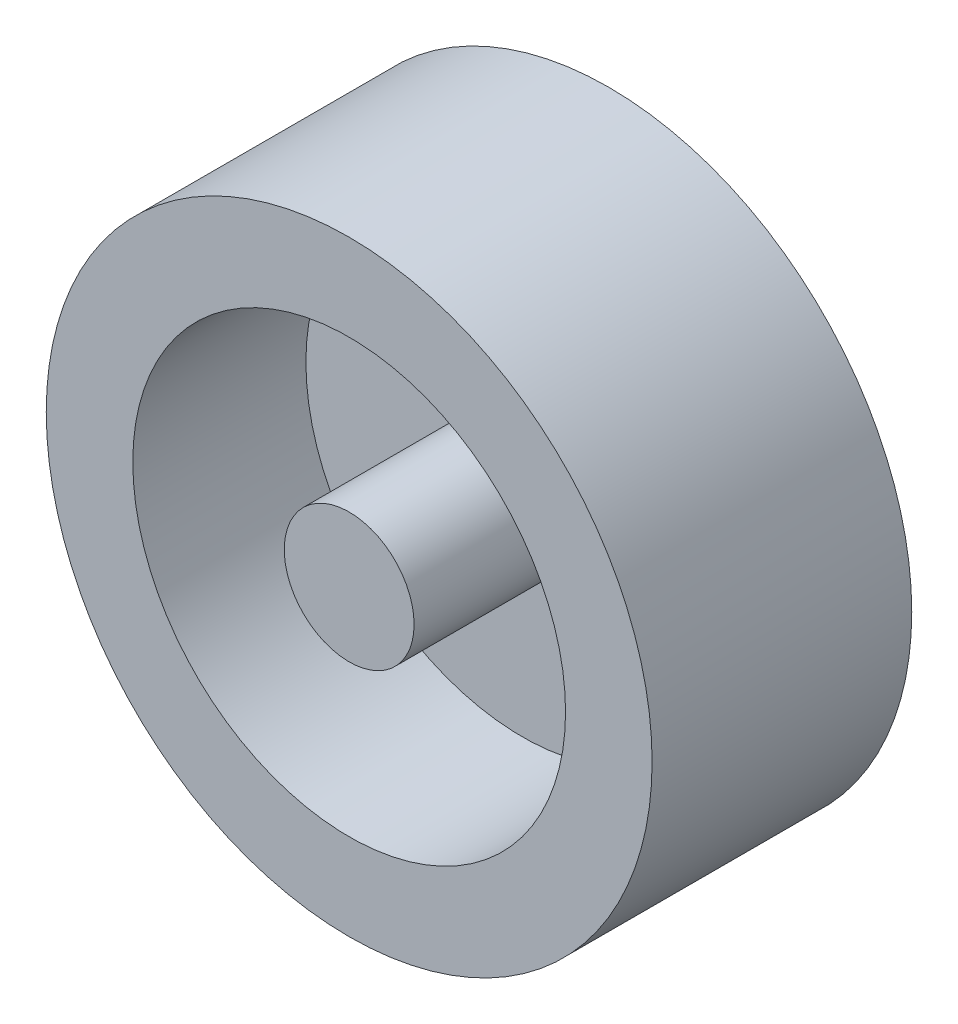
ISO-10303-21;
HEADER;
FILE_DESCRIPTION(('STEP AP214'),'2;1');
FILE_NAME('part.step','',(''),(''),'','','');
FILE_SCHEMA(('AUTOMOTIVE_DESIGN { 1 0 10303 214 1 1 1 1 }'));
ENDSEC;
DATA;
#1=APPLICATION_CONTEXT('core data for automotive mechanical design processes');
#2=APPLICATION_PROTOCOL_DEFINITION('international standard','automotive_design',2000,#1);
#3=PRODUCT_CONTEXT('',#1,'mechanical');
#4=PRODUCT('Part','Part','',(#3));
#5=PRODUCT_RELATED_PRODUCT_CATEGORY('part','',(#4));
#6=PRODUCT_DEFINITION_FORMATION('','',#4);
#7=PRODUCT_DEFINITION_CONTEXT('part definition',#1,'design');
#8=PRODUCT_DEFINITION('design','',#6,#7);
#9=PRODUCT_DEFINITION_SHAPE('','',#8);
#10=(LENGTH_UNIT() NAMED_UNIT(*) SI_UNIT(.MILLI.,.METRE.));
#11=(NAMED_UNIT(*) PLANE_ANGLE_UNIT() SI_UNIT($,.RADIAN.));
#12=(NAMED_UNIT(*) SI_UNIT($,.STERADIAN.) SOLID_ANGLE_UNIT());
#13=UNCERTAINTY_MEASURE_WITH_UNIT(LENGTH_MEASURE(1.E-05),#10,'distance_accuracy_value','');
#14=(GEOMETRIC_REPRESENTATION_CONTEXT(3) GLOBAL_UNCERTAINTY_ASSIGNED_CONTEXT((#13)) GLOBAL_UNIT_ASSIGNED_CONTEXT((#10,
#11,#12)) REPRESENTATION_CONTEXT('',''));
#15=CARTESIAN_POINT('',(0.,0.,0.));
#16=DIRECTION('',(0.,0.,1.));
#17=DIRECTION('',(1.,0.,0.));
#18=AXIS2_PLACEMENT_3D('',#15,#16,#17);
#19=CARTESIAN_POINT('',(0.,0.,3.));
#20=DIRECTION('',(0.,0.,-1.));
#21=DIRECTION('',(-1.,0.,0.));
#22=AXIS2_PLACEMENT_3D('',#19,#20,#21);
#23=CYLINDRICAL_SURFACE('',#22,3.5);
#24=CARTESIAN_POINT('',(0.,0.,3.));
#25=DIRECTION('',(0.,0.,1.));
#26=DIRECTION('',(1.,0.,0.));
#27=AXIS2_PLACEMENT_3D('',#24,#25,#26);
#28=CIRCLE('',#27,3.5);
#29=CARTESIAN_POINT('',(3.5,0.,3.));
#30=VERTEX_POINT('',#29);
#31=EDGE_CURVE('E10',#30,#30,#28,.T.);
#32=ORIENTED_EDGE('',*,*,#31,.F.);
#33=EDGE_LOOP('',(#32));
#34=FACE_BOUND('',#33,.T.);
#35=CARTESIAN_POINT('',(0.,0.,0.));
#36=DIRECTION('',(0.,0.,1.));
#37=DIRECTION('',(1.,0.,0.));
#38=AXIS2_PLACEMENT_3D('',#35,#36,#37);
#39=CIRCLE('',#38,3.5);
#40=CARTESIAN_POINT('',(3.5,0.,0.));
#41=VERTEX_POINT('',#40);
#42=EDGE_CURVE('E36',#41,#41,#39,.T.);
#43=ORIENTED_EDGE('',*,*,#42,.T.);
#44=EDGE_LOOP('',(#43));
#45=FACE_BOUND('',#44,.T.);
#46=ADVANCED_FACE('F33',(#34,#45),#23,.T.);
#47=CARTESIAN_POINT('',(0.,0.,3.));
#48=DIRECTION('',(0.,0.,1.));
#49=DIRECTION('',(1.,0.,0.));
#50=AXIS2_PLACEMENT_3D('',#47,#48,#49);
#51=PLANE('',#50);
#52=CARTESIAN_POINT('',(0.,0.,3.));
#53=DIRECTION('',(0.,0.,1.));
#54=DIRECTION('',(1.,0.,0.));
#55=AXIS2_PLACEMENT_3D('',#52,#53,#54);
#56=CIRCLE('',#55,2.5);
#57=CARTESIAN_POINT('',(2.5,0.,3.));
#58=VERTEX_POINT('',#57);
#59=EDGE_CURVE('E45',#58,#58,#56,.T.);
#60=ORIENTED_EDGE('',*,*,#59,.F.);
#61=EDGE_LOOP('',(#60));
#62=FACE_BOUND('',#61,.T.);
#63=ORIENTED_EDGE('',*,*,#31,.T.);
#64=EDGE_LOOP('',(#63));
#65=FACE_BOUND('',#64,.T.);
#66=ADVANCED_FACE('F78',(#62,#65),#51,.T.);
#67=CARTESIAN_POINT('',(0.,0.,0.));
#68=DIRECTION('',(0.,0.,1.));
#69=DIRECTION('',(1.,0.,0.));
#70=AXIS2_PLACEMENT_3D('',#67,#68,#69);
#71=PLANE('',#70);
#72=ORIENTED_EDGE('',*,*,#42,.F.);
#73=EDGE_LOOP('',(#72));
#74=FACE_BOUND('',#73,.T.);
#75=ADVANCED_FACE('F74',(#74),#71,.F.);
#76=CARTESIAN_POINT('',(0.,0.,1.));
#77=DIRECTION('',(0.,0.,1.));
#78=DIRECTION('',(1.,0.,0.));
#79=AXIS2_PLACEMENT_3D('',#76,#77,#78);
#80=CYLINDRICAL_SURFACE('',#79,2.5);
#81=CARTESIAN_POINT('',(0.,0.,1.));
#82=DIRECTION('',(0.,0.,1.));
#83=DIRECTION('',(1.,0.,0.));
#84=AXIS2_PLACEMENT_3D('',#81,#82,#83);
#85=CIRCLE('',#84,2.5);
#86=CARTESIAN_POINT('',(2.5,0.,1.));
#87=VERTEX_POINT('',#86);
#88=EDGE_CURVE('E43',#87,#87,#85,.T.);
#89=ORIENTED_EDGE('',*,*,#88,.F.);
#90=EDGE_LOOP('',(#89));
#91=FACE_BOUND('',#90,.T.);
#92=ORIENTED_EDGE('',*,*,#59,.T.);
#93=EDGE_LOOP('',(#92));
#94=FACE_BOUND('',#93,.T.);
#95=ADVANCED_FACE('F68',(#91,#94),#80,.F.);
#96=CARTESIAN_POINT('',(0.,0.,1.));
#97=DIRECTION('',(0.,0.,1.));
#98=DIRECTION('',(1.,0.,0.));
#99=AXIS2_PLACEMENT_3D('',#96,#97,#98);
#100=PLANE('',#99);
#101=CARTESIAN_POINT('',(0.,0.,1.));
#102=DIRECTION('',(0.,0.,1.));
#103=DIRECTION('',(1.,0.,0.));
#104=AXIS2_PLACEMENT_3D('',#101,#102,#103);
#105=CIRCLE('',#104,0.75);
#106=CARTESIAN_POINT('',(0.75,0.,1.));
#107=VERTEX_POINT('',#106);
#108=EDGE_CURVE('E51',#107,#107,#105,.T.);
#109=ORIENTED_EDGE('',*,*,#108,.F.);
#110=EDGE_LOOP('',(#109));
#111=FACE_BOUND('',#110,.T.);
#112=ORIENTED_EDGE('',*,*,#88,.T.);
#113=EDGE_LOOP('',(#112));
#114=FACE_BOUND('',#113,.T.);
#115=ADVANCED_FACE('F62',(#111,#114),#100,.T.);
#116=CARTESIAN_POINT('',(0.,0.,3.));
#117=DIRECTION('',(0.,0.,-1.));
#118=DIRECTION('',(-1.,0.,0.));
#119=AXIS2_PLACEMENT_3D('',#116,#117,#118);
#120=CYLINDRICAL_SURFACE('',#119,0.75);
#121=CARTESIAN_POINT('',(0.,0.,3.));
#122=DIRECTION('',(0.,0.,1.));
#123=DIRECTION('',(1.,0.,0.));
#124=AXIS2_PLACEMENT_3D('',#121,#122,#123);
#125=CIRCLE('',#124,0.75);
#126=CARTESIAN_POINT('',(0.75,0.,3.));
#127=VERTEX_POINT('',#126);
#128=EDGE_CURVE('E48',#127,#127,#125,.T.);
#129=ORIENTED_EDGE('',*,*,#128,.F.);
#130=EDGE_LOOP('',(#129));
#131=FACE_BOUND('',#130,.T.);
#132=ORIENTED_EDGE('',*,*,#108,.T.);
#133=EDGE_LOOP('',(#132));
#134=FACE_BOUND('',#133,.T.);
#135=ADVANCED_FACE('F59',(#131,#134),#120,.T.);
#136=CARTESIAN_POINT('',(0.,0.,3.));
#137=DIRECTION('',(0.,0.,1.));
#138=DIRECTION('',(1.,0.,0.));
#139=AXIS2_PLACEMENT_3D('',#136,#137,#138);
#140=PLANE('',#139);
#141=ORIENTED_EDGE('',*,*,#128,.T.);
#142=EDGE_LOOP('',(#141));
#143=FACE_BOUND('',#142,.T.);
#144=ADVANCED_FACE('F57',(#143),#140,.T.);
#145=CLOSED_SHELL('',(#46,#66,#75,#95,#115,#135,#144));
#146=MANIFOLD_SOLID_BREP('B2',#145);
#147=ADVANCED_BREP_SHAPE_REPRESENTATION('',(#18,#146),#14);
#148=SHAPE_DEFINITION_REPRESENTATION(#9,#147);
ENDSEC;
END-ISO-10303-21;
